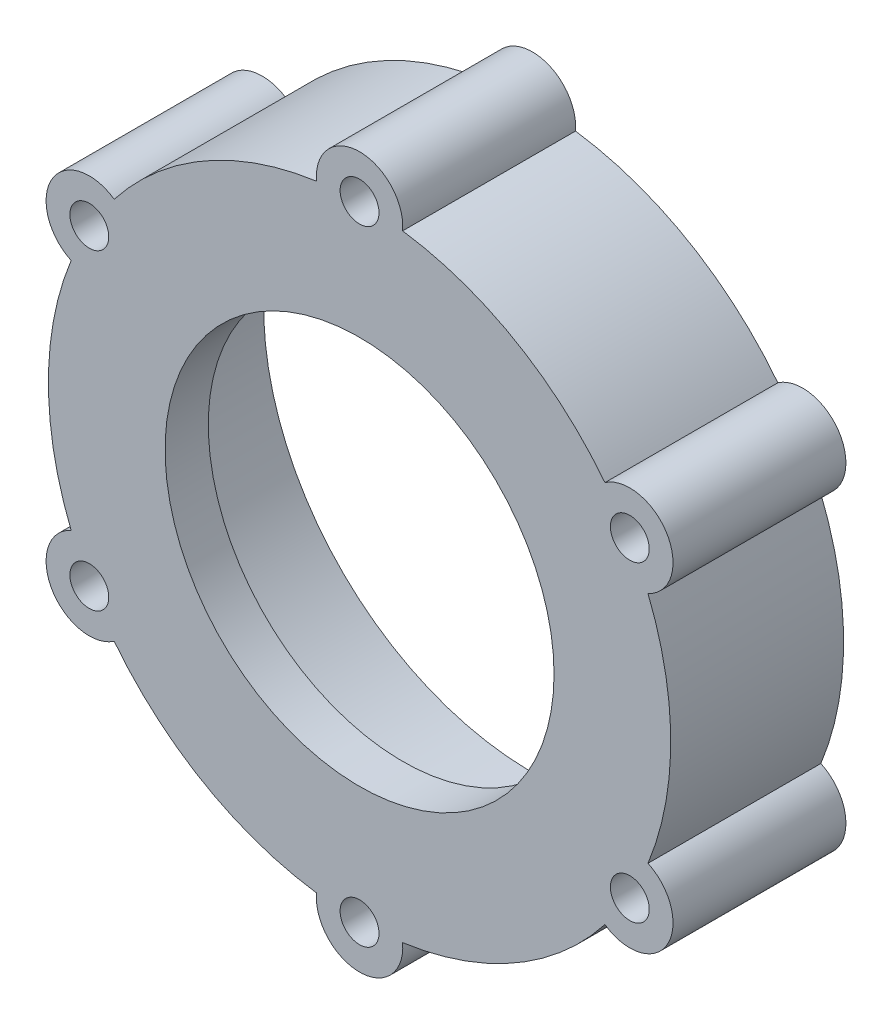
ISO-10303-21;
HEADER;
FILE_DESCRIPTION(('STEP AP214'),'2;1');
FILE_NAME('part.step','',(''),(''),'','','');
FILE_SCHEMA(('AUTOMOTIVE_DESIGN { 1 0 10303 214 1 1 1 1 }'));
ENDSEC;
DATA;
#1=APPLICATION_CONTEXT('core data for automotive mechanical design processes');
#2=APPLICATION_PROTOCOL_DEFINITION('international standard','automotive_design',2000,#1);
#3=PRODUCT_CONTEXT('',#1,'mechanical');
#4=PRODUCT('Part','Part','',(#3));
#5=PRODUCT_RELATED_PRODUCT_CATEGORY('part','',(#4));
#6=PRODUCT_DEFINITION_FORMATION('','',#4);
#7=PRODUCT_DEFINITION_CONTEXT('part definition',#1,'design');
#8=PRODUCT_DEFINITION('design','',#6,#7);
#9=PRODUCT_DEFINITION_SHAPE('','',#8);
#10=(LENGTH_UNIT() NAMED_UNIT(*) SI_UNIT(.MILLI.,.METRE.));
#11=(NAMED_UNIT(*) PLANE_ANGLE_UNIT() SI_UNIT($,.RADIAN.));
#12=(NAMED_UNIT(*) SI_UNIT($,.STERADIAN.) SOLID_ANGLE_UNIT());
#13=UNCERTAINTY_MEASURE_WITH_UNIT(LENGTH_MEASURE(1.E-05),#10,'distance_accuracy_value','');
#14=(GEOMETRIC_REPRESENTATION_CONTEXT(3) GLOBAL_UNCERTAINTY_ASSIGNED_CONTEXT((#13)) GLOBAL_UNIT_ASSIGNED_CONTEXT((#10,
#11,#12)) REPRESENTATION_CONTEXT('',''));
#15=CARTESIAN_POINT('',(0.,0.,0.));
#16=DIRECTION('',(0.,0.,1.));
#17=DIRECTION('',(1.,0.,0.));
#18=AXIS2_PLACEMENT_3D('',#15,#16,#17);
#19=CARTESIAN_POINT('',(0.,0.,15.));
#20=DIRECTION('',(0.,0.,-1.));
#21=DIRECTION('',(-1.,0.,0.));
#22=AXIS2_PLACEMENT_3D('',#19,#20,#21);
#23=CYLINDRICAL_SURFACE('',#22,36.);
#24=CARTESIAN_POINT('',(0.,0.,0.));
#25=DIRECTION('',(0.,0.,1.));
#26=DIRECTION('',(1.,0.,0.));
#27=AXIS2_PLACEMENT_3D('',#24,#25,#26);
#28=CIRCLE('',#27,36.);
#29=CARTESIAN_POINT('',(33.3671930707812,-13.5140825281337,0.));
#30=VERTEX_POINT('',#29);
#31=CARTESIAN_POINT('',(33.3671930707813,13.5140825281336,0.));
#32=VERTEX_POINT('',#31);
#33=EDGE_CURVE('E136',#30,#32,#28,.T.);
#34=ORIENTED_EDGE('',*,*,#33,.T.);
#35=DIRECTION('',(0.,0.,-1.));
#36=VECTOR('',#35,1.);
#37=CARTESIAN_POINT('',(33.3671930707813,13.5140825281336,10.));
#38=LINE('',#37,#36);
#39=CARTESIAN_POINT('',(33.3671930707813,13.5140825281336,20.));
#40=VERTEX_POINT('',#39);
#41=EDGE_CURVE('E122',#32,#40,#38,.F.);
#42=ORIENTED_EDGE('',*,*,#41,.T.);
#43=CARTESIAN_POINT('',(0.,0.,20.));
#44=DIRECTION('',(0.,0.,1.));
#45=DIRECTION('',(1.,0.,0.));
#46=AXIS2_PLACEMENT_3D('',#43,#44,#45);
#47=CIRCLE('',#46,36.);
#48=CARTESIAN_POINT('',(33.3671930707812,-13.5140825281337,20.));
#49=VERTEX_POINT('',#48);
#50=EDGE_CURVE('E332',#49,#40,#47,.T.);
#51=ORIENTED_EDGE('',*,*,#50,.F.);
#52=DIRECTION('',(0.,0.,-1.));
#53=VECTOR('',#52,1.);
#54=CARTESIAN_POINT('',(33.3671930707812,-13.5140825281337,10.));
#55=LINE('',#54,#53);
#56=EDGE_CURVE('E140',#49,#30,#55,.T.);
#57=ORIENTED_EDGE('',*,*,#56,.T.);
#58=EDGE_LOOP('',(#34,#42,#51,#57));
#59=FACE_BOUND('',#58,.T.);
#60=ADVANCED_FACE('F34',(#59),#23,.T.);
#61=CARTESIAN_POINT('',(4.98005775718744,-35.6538781163435,0.));
#62=VERTEX_POINT('',#61);
#63=CARTESIAN_POINT('',(28.3871353135938,-22.1397955882098,0.));
#64=VERTEX_POINT('',#63);
#65=EDGE_CURVE('E141',#62,#64,#28,.T.);
#66=ORIENTED_EDGE('',*,*,#65,.T.);
#67=DIRECTION('',(0.,0.,-1.));
#68=VECTOR('',#67,1.);
#69=CARTESIAN_POINT('',(28.3871353135938,-22.1397955882098,10.));
#70=LINE('',#69,#68);
#71=CARTESIAN_POINT('',(28.3871353135938,-22.1397955882098,20.));
#72=VERTEX_POINT('',#71);
#73=EDGE_CURVE('E209',#64,#72,#70,.F.);
#74=ORIENTED_EDGE('',*,*,#73,.T.);
#75=CARTESIAN_POINT('',(4.98005775718743,-35.6538781163435,20.));
#76=VERTEX_POINT('',#75);
#77=EDGE_CURVE('E328',#76,#72,#47,.T.);
#78=ORIENTED_EDGE('',*,*,#77,.F.);
#79=DIRECTION('',(0.,0.,-1.));
#80=VECTOR('',#79,1.);
#81=CARTESIAN_POINT('',(4.98005775718743,-35.6538781163435,10.));
#82=LINE('',#81,#80);
#83=EDGE_CURVE('E201',#76,#62,#82,.T.);
#84=ORIENTED_EDGE('',*,*,#83,.T.);
#85=EDGE_LOOP('',(#66,#74,#78,#84));
#86=FACE_BOUND('',#85,.T.);
#87=ADVANCED_FACE('F293',(#86),#23,.T.);
#88=CARTESIAN_POINT('',(-28.3871353135938,-22.1397955882098,0.));
#89=VERTEX_POINT('',#88);
#90=CARTESIAN_POINT('',(-4.98005775718744,-35.6538781163435,0.));
#91=VERTEX_POINT('',#90);
#92=EDGE_CURVE('E143',#89,#91,#28,.T.);
#93=ORIENTED_EDGE('',*,*,#92,.T.);
#94=DIRECTION('',(0.,0.,-1.));
#95=VECTOR('',#94,1.);
#96=CARTESIAN_POINT('',(-4.98005775718744,-35.6538781163435,10.));
#97=LINE('',#96,#95);
#98=CARTESIAN_POINT('',(-4.98005775718744,-35.6538781163435,20.));
#99=VERTEX_POINT('',#98);
#100=EDGE_CURVE('E198',#91,#99,#97,.F.);
#101=ORIENTED_EDGE('',*,*,#100,.T.);
#102=CARTESIAN_POINT('',(-28.3871353135938,-22.1397955882098,20.));
#103=VERTEX_POINT('',#102);
#104=EDGE_CURVE('E326',#103,#99,#47,.T.);
#105=ORIENTED_EDGE('',*,*,#104,.F.);
#106=DIRECTION('',(0.,0.,-1.));
#107=VECTOR('',#106,1.);
#108=CARTESIAN_POINT('',(-28.3871353135938,-22.1397955882098,10.));
#109=LINE('',#108,#107);
#110=EDGE_CURVE('E190',#103,#89,#109,.T.);
#111=ORIENTED_EDGE('',*,*,#110,.T.);
#112=EDGE_LOOP('',(#93,#101,#105,#111));
#113=FACE_BOUND('',#112,.T.);
#114=ADVANCED_FACE('F297',(#113),#23,.T.);
#115=CARTESIAN_POINT('',(-33.3671930707812,13.5140825281337,0.));
#116=VERTEX_POINT('',#115);
#117=CARTESIAN_POINT('',(-33.3671930707812,-13.5140825281337,0.));
#118=VERTEX_POINT('',#117);
#119=EDGE_CURVE('E42',#116,#118,#28,.T.);
#120=ORIENTED_EDGE('',*,*,#119,.T.);
#121=DIRECTION('',(0.,0.,-1.));
#122=VECTOR('',#121,1.);
#123=CARTESIAN_POINT('',(-33.3671930707812,-13.5140825281337,10.));
#124=LINE('',#123,#122);
#125=CARTESIAN_POINT('',(-33.3671930707812,-13.5140825281337,20.));
#126=VERTEX_POINT('',#125);
#127=EDGE_CURVE('E187',#118,#126,#124,.F.);
#128=ORIENTED_EDGE('',*,*,#127,.T.);
#129=CARTESIAN_POINT('',(-33.3671930707812,13.5140825281337,20.));
#130=VERTEX_POINT('',#129);
#131=EDGE_CURVE('E158',#130,#126,#47,.T.);
#132=ORIENTED_EDGE('',*,*,#131,.F.);
#133=DIRECTION('',(0.,0.,-1.));
#134=VECTOR('',#133,1.);
#135=CARTESIAN_POINT('',(-33.3671930707812,13.5140825281337,10.));
#136=LINE('',#135,#134);
#137=EDGE_CURVE('E179',#130,#116,#136,.T.);
#138=ORIENTED_EDGE('',*,*,#137,.T.);
#139=EDGE_LOOP('',(#120,#128,#132,#138));
#140=FACE_BOUND('',#139,.T.);
#141=ADVANCED_FACE('F309',(#140),#23,.T.);
#142=CARTESIAN_POINT('',(-4.98005775718743,35.6538781163435,0.));
#143=VERTEX_POINT('',#142);
#144=CARTESIAN_POINT('',(-28.3871353135938,22.1397955882098,0.));
#145=VERTEX_POINT('',#144);
#146=EDGE_CURVE('E11',#143,#145,#28,.T.);
#147=ORIENTED_EDGE('',*,*,#146,.T.);
#148=DIRECTION('',(0.,0.,-1.));
#149=VECTOR('',#148,1.);
#150=CARTESIAN_POINT('',(-28.3871353135938,22.1397955882098,10.));
#151=LINE('',#150,#149);
#152=CARTESIAN_POINT('',(-28.3871353135938,22.1397955882098,20.));
#153=VERTEX_POINT('',#152);
#154=EDGE_CURVE('E176',#145,#153,#151,.F.);
#155=ORIENTED_EDGE('',*,*,#154,.T.);
#156=CARTESIAN_POINT('',(-4.98005775718744,35.6538781163435,20.));
#157=VERTEX_POINT('',#156);
#158=EDGE_CURVE('E153',#157,#153,#47,.T.);
#159=ORIENTED_EDGE('',*,*,#158,.F.);
#160=DIRECTION('',(0.,0.,-1.));
#161=VECTOR('',#160,1.);
#162=CARTESIAN_POINT('',(-4.98005775718744,35.6538781163435,10.));
#163=LINE('',#162,#161);
#164=EDGE_CURVE('E168',#157,#143,#163,.T.);
#165=ORIENTED_EDGE('',*,*,#164,.T.);
#166=EDGE_LOOP('',(#147,#155,#159,#165));
#167=FACE_BOUND('',#166,.T.);
#168=ADVANCED_FACE('F266',(#167),#23,.T.);
#169=CARTESIAN_POINT('',(0.,0.,0.));
#170=DIRECTION('',(0.,0.,1.));
#171=DIRECTION('',(1.,0.,0.));
#172=AXIS2_PLACEMENT_3D('',#169,#170,#171);
#173=PLANE('',#172);
#174=CARTESIAN_POINT('',(0.,36.1,0.));
#175=DIRECTION('',(0.,0.,-1.));
#176=DIRECTION('',(-1.,0.,0.));
#177=AXIS2_PLACEMENT_3D('',#174,#175,#176);
#178=CIRCLE('',#177,2.25);
#179=CARTESIAN_POINT('',(-2.24999999999995,36.1,0.));
#180=VERTEX_POINT('',#179);
#181=EDGE_CURVE('E248',#180,#180,#178,.T.);
#182=ORIENTED_EDGE('',*,*,#181,.F.);
#183=EDGE_LOOP('',(#182));
#184=FACE_BOUND('',#183,.T.);
#185=CARTESIAN_POINT('',(-31.2635170766182,18.05,0.));
#186=DIRECTION('',(0.,0.,-1.));
#187=DIRECTION('',(-1.,0.,0.));
#188=AXIS2_PLACEMENT_3D('',#185,#186,#187);
#189=CIRCLE('',#188,2.25);
#190=CARTESIAN_POINT('',(-33.5135170766182,18.05,0.));
#191=VERTEX_POINT('',#190);
#192=EDGE_CURVE('E242',#191,#191,#189,.T.);
#193=ORIENTED_EDGE('',*,*,#192,.F.);
#194=EDGE_LOOP('',(#193));
#195=FACE_BOUND('',#194,.T.);
#196=CARTESIAN_POINT('',(-31.2635170766182,-18.05,0.));
#197=DIRECTION('',(0.,0.,-1.));
#198=DIRECTION('',(-1.,0.,0.));
#199=AXIS2_PLACEMENT_3D('',#196,#197,#198);
#200=CIRCLE('',#199,2.25);
#201=CARTESIAN_POINT('',(-33.5135170766182,-18.05,0.));
#202=VERTEX_POINT('',#201);
#203=EDGE_CURVE('E236',#202,#202,#200,.T.);
#204=ORIENTED_EDGE('',*,*,#203,.F.);
#205=EDGE_LOOP('',(#204));
#206=FACE_BOUND('',#205,.T.);
#207=CARTESIAN_POINT('',(0.,-36.1,0.));
#208=DIRECTION('',(0.,0.,-1.));
#209=DIRECTION('',(-1.,0.,0.));
#210=AXIS2_PLACEMENT_3D('',#207,#208,#209);
#211=CIRCLE('',#210,2.25);
#212=CARTESIAN_POINT('',(-2.25000000000005,-36.1,0.));
#213=VERTEX_POINT('',#212);
#214=EDGE_CURVE('E230',#213,#213,#211,.T.);
#215=ORIENTED_EDGE('',*,*,#214,.F.);
#216=EDGE_LOOP('',(#215));
#217=FACE_BOUND('',#216,.T.);
#218=CARTESIAN_POINT('',(31.2635170766182,-18.05,0.));
#219=DIRECTION('',(0.,0.,-1.));
#220=DIRECTION('',(-1.,0.,0.));
#221=AXIS2_PLACEMENT_3D('',#218,#219,#220);
#222=CIRCLE('',#221,2.25);
#223=CARTESIAN_POINT('',(29.0135170766182,-18.05,0.));
#224=VERTEX_POINT('',#223);
#225=EDGE_CURVE('E224',#224,#224,#222,.T.);
#226=ORIENTED_EDGE('',*,*,#225,.F.);
#227=EDGE_LOOP('',(#226));
#228=FACE_BOUND('',#227,.T.);
#229=CARTESIAN_POINT('',(31.2635170766182,18.05,0.));
#230=DIRECTION('',(0.,0.,-1.));
#231=DIRECTION('',(-1.,0.,0.));
#232=AXIS2_PLACEMENT_3D('',#229,#230,#231);
#233=CIRCLE('',#232,2.25);
#234=CARTESIAN_POINT('',(29.0135170766183,18.05,0.));
#235=VERTEX_POINT('',#234);
#236=EDGE_CURVE('E218',#235,#235,#233,.T.);
#237=ORIENTED_EDGE('',*,*,#236,.F.);
#238=EDGE_LOOP('',(#237));
#239=FACE_BOUND('',#238,.T.);
#240=CARTESIAN_POINT('',(0.,0.,0.));
#241=DIRECTION('',(0.,0.,1.));
#242=DIRECTION('',(1.,0.,0.));
#243=AXIS2_PLACEMENT_3D('',#240,#241,#242);
#244=CIRCLE('',#243,31.1);
#245=CARTESIAN_POINT('',(31.1,0.,0.));
#246=VERTEX_POINT('',#245);
#247=EDGE_CURVE('E144',#246,#246,#244,.T.);
#248=ORIENTED_EDGE('',*,*,#247,.T.);
#249=EDGE_LOOP('',(#248));
#250=FACE_BOUND('',#249,.T.);
#251=CARTESIAN_POINT('',(28.3871353135938,22.1397955882098,0.));
#252=VERTEX_POINT('',#251);
#253=CARTESIAN_POINT('',(4.98005775718744,35.6538781163435,0.));
#254=VERTEX_POINT('',#253);
#255=EDGE_CURVE('E43',#252,#254,#28,.T.);
#256=ORIENTED_EDGE('',*,*,#255,.F.);
#257=CARTESIAN_POINT('',(31.2635170766182,18.05,0.));
#258=DIRECTION('',(0.,0.,-1.));
#259=DIRECTION('',(-1.,0.,0.));
#260=AXIS2_PLACEMENT_3D('',#257,#258,#259);
#261=CIRCLE('',#260,5.);
#262=EDGE_CURVE('E50',#252,#32,#261,.T.);
#263=ORIENTED_EDGE('',*,*,#262,.T.);
#264=ORIENTED_EDGE('',*,*,#33,.F.);
#265=CARTESIAN_POINT('',(31.2635170766182,-18.05,0.));
#266=DIRECTION('',(0.,0.,-1.));
#267=DIRECTION('',(-1.,0.,0.));
#268=AXIS2_PLACEMENT_3D('',#265,#266,#267);
#269=CIRCLE('',#268,5.);
#270=EDGE_CURVE('E58',#30,#64,#269,.T.);
#271=ORIENTED_EDGE('',*,*,#270,.T.);
#272=ORIENTED_EDGE('',*,*,#65,.F.);
#273=CARTESIAN_POINT('',(0.,-36.1,0.));
#274=DIRECTION('',(0.,0.,-1.));
#275=DIRECTION('',(-1.,0.,0.));
#276=AXIS2_PLACEMENT_3D('',#273,#274,#275);
#277=CIRCLE('',#276,5.);
#278=EDGE_CURVE('E206',#62,#91,#277,.T.);
#279=ORIENTED_EDGE('',*,*,#278,.T.);
#280=ORIENTED_EDGE('',*,*,#92,.F.);
#281=CARTESIAN_POINT('',(-31.2635170766182,-18.05,0.));
#282=DIRECTION('',(0.,0.,-1.));
#283=DIRECTION('',(-1.,0.,0.));
#284=AXIS2_PLACEMENT_3D('',#281,#282,#283);
#285=CIRCLE('',#284,5.);
#286=EDGE_CURVE('E195',#89,#118,#285,.T.);
#287=ORIENTED_EDGE('',*,*,#286,.T.);
#288=ORIENTED_EDGE('',*,*,#119,.F.);
#289=CARTESIAN_POINT('',(-31.2635170766182,18.05,0.));
#290=DIRECTION('',(0.,0.,-1.));
#291=DIRECTION('',(-1.,0.,0.));
#292=AXIS2_PLACEMENT_3D('',#289,#290,#291);
#293=CIRCLE('',#292,5.);
#294=EDGE_CURVE('E184',#116,#145,#293,.T.);
#295=ORIENTED_EDGE('',*,*,#294,.T.);
#296=ORIENTED_EDGE('',*,*,#146,.F.);
#297=CARTESIAN_POINT('',(0.,36.1,0.));
#298=DIRECTION('',(0.,0.,-1.));
#299=DIRECTION('',(-1.,0.,0.));
#300=AXIS2_PLACEMENT_3D('',#297,#298,#299);
#301=CIRCLE('',#300,5.);
#302=EDGE_CURVE('E174',#143,#254,#301,.T.);
#303=ORIENTED_EDGE('',*,*,#302,.T.);
#304=EDGE_LOOP('',(#256,#263,#264,#271,#272,#279,#280,#287,#288,#295,#296,#303));
#305=FACE_BOUND('',#304,.T.);
#306=ADVANCED_FACE('F135',(#184,#195,#206,#217,#228,#239,#250,#305),#173,.F.);
#307=CARTESIAN_POINT('',(28.3871353135938,22.1397955882098,20.));
#308=VERTEX_POINT('',#307);
#309=CARTESIAN_POINT('',(4.98005775718744,35.6538781163435,20.));
#310=VERTEX_POINT('',#309);
#311=EDGE_CURVE('E159',#308,#310,#47,.T.);
#312=ORIENTED_EDGE('',*,*,#311,.F.);
#313=DIRECTION('',(0.,0.,-1.));
#314=VECTOR('',#313,1.);
#315=CARTESIAN_POINT('',(28.3871353135938,22.1397955882098,10.));
#316=LINE('',#315,#314);
#317=EDGE_CURVE('E130',#308,#252,#316,.T.);
#318=ORIENTED_EDGE('',*,*,#317,.T.);
#319=ORIENTED_EDGE('',*,*,#255,.T.);
#320=DIRECTION('',(0.,0.,-1.));
#321=VECTOR('',#320,1.);
#322=CARTESIAN_POINT('',(4.98005775718744,35.6538781163435,10.));
#323=LINE('',#322,#321);
#324=EDGE_CURVE('E164',#254,#310,#323,.F.);
#325=ORIENTED_EDGE('',*,*,#324,.T.);
#326=EDGE_LOOP('',(#312,#318,#319,#325));
#327=FACE_BOUND('',#326,.T.);
#328=ADVANCED_FACE('F36',(#327),#23,.T.);
#329=CARTESIAN_POINT('',(0.,0.,15.));
#330=DIRECTION('',(0.,0.,-1.));
#331=DIRECTION('',(-1.,0.,0.));
#332=AXIS2_PLACEMENT_3D('',#329,#330,#331);
#333=CYLINDRICAL_SURFACE('',#332,31.1);
#334=ORIENTED_EDGE('',*,*,#247,.F.);
#335=EDGE_LOOP('',(#334));
#336=FACE_BOUND('',#335,.T.);
#337=CARTESIAN_POINT('',(0.,0.,15.));
#338=DIRECTION('',(0.,0.,1.));
#339=DIRECTION('',(1.,0.,0.));
#340=AXIS2_PLACEMENT_3D('',#337,#338,#339);
#341=CIRCLE('',#340,31.1);
#342=CARTESIAN_POINT('',(31.1,0.,15.));
#343=VERTEX_POINT('',#342);
#344=EDGE_CURVE('E149',#343,#343,#341,.T.);
#345=ORIENTED_EDGE('',*,*,#344,.T.);
#346=EDGE_LOOP('',(#345));
#347=FACE_BOUND('',#346,.T.);
#348=ADVANCED_FACE('F300',(#336,#347),#333,.F.);
#349=CARTESIAN_POINT('',(0.,0.,15.));
#350=DIRECTION('',(0.,0.,1.));
#351=DIRECTION('',(1.,0.,0.));
#352=AXIS2_PLACEMENT_3D('',#349,#350,#351);
#353=PLANE('',#352);
#354=CARTESIAN_POINT('',(0.,0.,15.));
#355=DIRECTION('',(0.,0.,1.));
#356=DIRECTION('',(1.,0.,0.));
#357=AXIS2_PLACEMENT_3D('',#354,#355,#356);
#358=CIRCLE('',#357,22.5);
#359=CARTESIAN_POINT('',(22.5,0.,15.));
#360=VERTEX_POINT('',#359);
#361=EDGE_CURVE('E163',#360,#360,#358,.T.);
#362=ORIENTED_EDGE('',*,*,#361,.T.);
#363=EDGE_LOOP('',(#362));
#364=FACE_BOUND('',#363,.T.);
#365=ORIENTED_EDGE('',*,*,#344,.F.);
#366=EDGE_LOOP('',(#365));
#367=FACE_BOUND('',#366,.T.);
#368=ADVANCED_FACE('F304',(#364,#367),#353,.F.);
#369=CARTESIAN_POINT('',(0.,0.,20.));
#370=DIRECTION('',(0.,0.,1.));
#371=DIRECTION('',(1.,0.,0.));
#372=AXIS2_PLACEMENT_3D('',#369,#370,#371);
#373=PLANE('',#372);
#374=CARTESIAN_POINT('',(0.,36.1,20.));
#375=DIRECTION('',(0.,0.,-1.));
#376=DIRECTION('',(-1.,0.,0.));
#377=AXIS2_PLACEMENT_3D('',#374,#375,#376);
#378=CIRCLE('',#377,2.25);
#379=CARTESIAN_POINT('',(-2.24999999999995,36.1,20.));
#380=VERTEX_POINT('',#379);
#381=EDGE_CURVE('E221',#380,#380,#378,.T.);
#382=ORIENTED_EDGE('',*,*,#381,.T.);
#383=EDGE_LOOP('',(#382));
#384=FACE_BOUND('',#383,.T.);
#385=CARTESIAN_POINT('',(-31.2635170766182,18.05,20.));
#386=DIRECTION('',(0.,0.,-1.));
#387=DIRECTION('',(-1.,0.,0.));
#388=AXIS2_PLACEMENT_3D('',#385,#386,#387);
#389=CIRCLE('',#388,2.25);
#390=CARTESIAN_POINT('',(-33.5135170766182,18.05,20.));
#391=VERTEX_POINT('',#390);
#392=EDGE_CURVE('E245',#391,#391,#389,.T.);
#393=ORIENTED_EDGE('',*,*,#392,.T.);
#394=EDGE_LOOP('',(#393));
#395=FACE_BOUND('',#394,.T.);
#396=CARTESIAN_POINT('',(-31.2635170766182,-18.05,20.));
#397=DIRECTION('',(0.,0.,-1.));
#398=DIRECTION('',(-1.,0.,0.));
#399=AXIS2_PLACEMENT_3D('',#396,#397,#398);
#400=CIRCLE('',#399,2.25);
#401=CARTESIAN_POINT('',(-33.5135170766182,-18.05,20.));
#402=VERTEX_POINT('',#401);
#403=EDGE_CURVE('E239',#402,#402,#400,.T.);
#404=ORIENTED_EDGE('',*,*,#403,.T.);
#405=EDGE_LOOP('',(#404));
#406=FACE_BOUND('',#405,.T.);
#407=CARTESIAN_POINT('',(0.,-36.1,20.));
#408=DIRECTION('',(0.,0.,-1.));
#409=DIRECTION('',(-1.,0.,0.));
#410=AXIS2_PLACEMENT_3D('',#407,#408,#409);
#411=CIRCLE('',#410,2.25);
#412=CARTESIAN_POINT('',(-2.25000000000005,-36.1,20.));
#413=VERTEX_POINT('',#412);
#414=EDGE_CURVE('E233',#413,#413,#411,.T.);
#415=ORIENTED_EDGE('',*,*,#414,.T.);
#416=EDGE_LOOP('',(#415));
#417=FACE_BOUND('',#416,.T.);
#418=CARTESIAN_POINT('',(31.2635170766182,-18.05,20.));
#419=DIRECTION('',(0.,0.,-1.));
#420=DIRECTION('',(-1.,0.,0.));
#421=AXIS2_PLACEMENT_3D('',#418,#419,#420);
#422=CIRCLE('',#421,2.25);
#423=CARTESIAN_POINT('',(29.0135170766182,-18.05,20.));
#424=VERTEX_POINT('',#423);
#425=EDGE_CURVE('E227',#424,#424,#422,.T.);
#426=ORIENTED_EDGE('',*,*,#425,.T.);
#427=EDGE_LOOP('',(#426));
#428=FACE_BOUND('',#427,.T.);
#429=CARTESIAN_POINT('',(31.2635170766182,18.05,20.));
#430=DIRECTION('',(0.,0.,-1.));
#431=DIRECTION('',(-1.,0.,0.));
#432=AXIS2_PLACEMENT_3D('',#429,#430,#431);
#433=CIRCLE('',#432,2.25);
#434=CARTESIAN_POINT('',(29.0135170766183,18.05,20.));
#435=VERTEX_POINT('',#434);
#436=EDGE_CURVE('E138',#435,#435,#433,.T.);
#437=ORIENTED_EDGE('',*,*,#436,.T.);
#438=EDGE_LOOP('',(#437));
#439=FACE_BOUND('',#438,.T.);
#440=ORIENTED_EDGE('',*,*,#50,.T.);
#441=CARTESIAN_POINT('',(31.2635170766182,18.05,20.));
#442=DIRECTION('',(0.,0.,1.));
#443=DIRECTION('',(1.,0.,0.));
#444=AXIS2_PLACEMENT_3D('',#441,#442,#443);
#445=CIRCLE('',#444,5.);
#446=EDGE_CURVE('E125',#308,#40,#445,.F.);
#447=ORIENTED_EDGE('',*,*,#446,.F.);
#448=ORIENTED_EDGE('',*,*,#311,.T.);
#449=CARTESIAN_POINT('',(0.,36.1,20.));
#450=DIRECTION('',(0.,0.,1.));
#451=DIRECTION('',(1.,0.,0.));
#452=AXIS2_PLACEMENT_3D('',#449,#450,#451);
#453=CIRCLE('',#452,5.);
#454=EDGE_CURVE('E171',#157,#310,#453,.F.);
#455=ORIENTED_EDGE('',*,*,#454,.F.);
#456=ORIENTED_EDGE('',*,*,#158,.T.);
#457=CARTESIAN_POINT('',(-31.2635170766182,18.05,20.));
#458=DIRECTION('',(0.,0.,1.));
#459=DIRECTION('',(1.,0.,0.));
#460=AXIS2_PLACEMENT_3D('',#457,#458,#459);
#461=CIRCLE('',#460,5.);
#462=EDGE_CURVE('E182',#130,#153,#461,.F.);
#463=ORIENTED_EDGE('',*,*,#462,.F.);
#464=ORIENTED_EDGE('',*,*,#131,.T.);
#465=CARTESIAN_POINT('',(-31.2635170766182,-18.05,20.));
#466=DIRECTION('',(0.,0.,1.));
#467=DIRECTION('',(1.,0.,0.));
#468=AXIS2_PLACEMENT_3D('',#465,#466,#467);
#469=CIRCLE('',#468,5.);
#470=EDGE_CURVE('E193',#103,#126,#469,.F.);
#471=ORIENTED_EDGE('',*,*,#470,.F.);
#472=ORIENTED_EDGE('',*,*,#104,.T.);
#473=CARTESIAN_POINT('',(0.,-36.1,20.));
#474=DIRECTION('',(0.,0.,1.));
#475=DIRECTION('',(1.,0.,0.));
#476=AXIS2_PLACEMENT_3D('',#473,#474,#475);
#477=CIRCLE('',#476,5.);
#478=EDGE_CURVE('E204',#76,#99,#477,.F.);
#479=ORIENTED_EDGE('',*,*,#478,.F.);
#480=ORIENTED_EDGE('',*,*,#77,.T.);
#481=CARTESIAN_POINT('',(31.2635170766182,-18.05,20.));
#482=DIRECTION('',(0.,0.,1.));
#483=DIRECTION('',(1.,0.,0.));
#484=AXIS2_PLACEMENT_3D('',#481,#482,#483);
#485=CIRCLE('',#484,5.);
#486=EDGE_CURVE('E213',#49,#72,#485,.F.);
#487=ORIENTED_EDGE('',*,*,#486,.F.);
#488=EDGE_LOOP('',(#440,#447,#448,#455,#456,#463,#464,#471,#472,#479,#480,#487));
#489=FACE_BOUND('',#488,.T.);
#490=CARTESIAN_POINT('',(0.,0.,20.));
#491=DIRECTION('',(0.,0.,1.));
#492=DIRECTION('',(1.,0.,0.));
#493=AXIS2_PLACEMENT_3D('',#490,#491,#492);
#494=CIRCLE('',#493,22.5);
#495=CARTESIAN_POINT('',(22.5,0.,20.));
#496=VERTEX_POINT('',#495);
#497=EDGE_CURVE('E160',#496,#496,#494,.T.);
#498=ORIENTED_EDGE('',*,*,#497,.F.);
#499=EDGE_LOOP('',(#498));
#500=FACE_BOUND('',#499,.T.);
#501=ADVANCED_FACE('F254',(#384,#395,#406,#417,#428,#439,#489,#500),#373,.T.);
#502=CARTESIAN_POINT('',(0.,0.,15.));
#503=DIRECTION('',(0.,0.,1.));
#504=DIRECTION('',(1.,0.,0.));
#505=AXIS2_PLACEMENT_3D('',#502,#503,#504);
#506=CYLINDRICAL_SURFACE('',#505,22.5);
#507=ORIENTED_EDGE('',*,*,#361,.F.);
#508=EDGE_LOOP('',(#507));
#509=FACE_BOUND('',#508,.T.);
#510=ORIENTED_EDGE('',*,*,#497,.T.);
#511=EDGE_LOOP('',(#510));
#512=FACE_BOUND('',#511,.T.);
#513=ADVANCED_FACE('F340',(#509,#512),#506,.F.);
#514=CARTESIAN_POINT('',(0.,36.1,34.142135623731));
#515=DIRECTION('',(0.,0.,-1.));
#516=DIRECTION('',(-1.,0.,0.));
#517=AXIS2_PLACEMENT_3D('',#514,#515,#516);
#518=CYLINDRICAL_SURFACE('',#517,5.);
#519=ORIENTED_EDGE('',*,*,#324,.F.);
#520=ORIENTED_EDGE('',*,*,#302,.F.);
#521=ORIENTED_EDGE('',*,*,#164,.F.);
#522=ORIENTED_EDGE('',*,*,#454,.T.);
#523=EDGE_LOOP('',(#519,#520,#521,#522));
#524=FACE_BOUND('',#523,.T.);
#525=ADVANCED_FACE('F338',(#524),#518,.T.);
#526=CARTESIAN_POINT('',(-31.2635170766182,18.05,34.142135623731));
#527=DIRECTION('',(0.,0.,-1.));
#528=DIRECTION('',(-1.,0.,0.));
#529=AXIS2_PLACEMENT_3D('',#526,#527,#528);
#530=CYLINDRICAL_SURFACE('',#529,5.);
#531=ORIENTED_EDGE('',*,*,#154,.F.);
#532=ORIENTED_EDGE('',*,*,#294,.F.);
#533=ORIENTED_EDGE('',*,*,#137,.F.);
#534=ORIENTED_EDGE('',*,*,#462,.T.);
#535=EDGE_LOOP('',(#531,#532,#533,#534));
#536=FACE_BOUND('',#535,.T.);
#537=ADVANCED_FACE('F320',(#536),#530,.T.);
#538=CARTESIAN_POINT('',(-31.2635170766182,-18.05,34.142135623731));
#539=DIRECTION('',(0.,0.,-1.));
#540=DIRECTION('',(-1.,0.,0.));
#541=AXIS2_PLACEMENT_3D('',#538,#539,#540);
#542=CYLINDRICAL_SURFACE('',#541,5.);
#543=ORIENTED_EDGE('',*,*,#127,.F.);
#544=ORIENTED_EDGE('',*,*,#286,.F.);
#545=ORIENTED_EDGE('',*,*,#110,.F.);
#546=ORIENTED_EDGE('',*,*,#470,.T.);
#547=EDGE_LOOP('',(#543,#544,#545,#546));
#548=FACE_BOUND('',#547,.T.);
#549=ADVANCED_FACE('F346',(#548),#542,.T.);
#550=CARTESIAN_POINT('',(0.,-36.1,34.142135623731));
#551=DIRECTION('',(0.,0.,-1.));
#552=DIRECTION('',(-1.,0.,0.));
#553=AXIS2_PLACEMENT_3D('',#550,#551,#552);
#554=CYLINDRICAL_SURFACE('',#553,5.);
#555=ORIENTED_EDGE('',*,*,#100,.F.);
#556=ORIENTED_EDGE('',*,*,#278,.F.);
#557=ORIENTED_EDGE('',*,*,#83,.F.);
#558=ORIENTED_EDGE('',*,*,#478,.T.);
#559=EDGE_LOOP('',(#555,#556,#557,#558));
#560=FACE_BOUND('',#559,.T.);
#561=ADVANCED_FACE('F481',(#560),#554,.T.);
#562=CARTESIAN_POINT('',(31.2635170766182,-18.05,34.142135623731));
#563=DIRECTION('',(0.,0.,-1.));
#564=DIRECTION('',(-1.,0.,0.));
#565=AXIS2_PLACEMENT_3D('',#562,#563,#564);
#566=CYLINDRICAL_SURFACE('',#565,5.);
#567=ORIENTED_EDGE('',*,*,#73,.F.);
#568=ORIENTED_EDGE('',*,*,#270,.F.);
#569=ORIENTED_EDGE('',*,*,#56,.F.);
#570=ORIENTED_EDGE('',*,*,#486,.T.);
#571=EDGE_LOOP('',(#567,#568,#569,#570));
#572=FACE_BOUND('',#571,.T.);
#573=ADVANCED_FACE('F289',(#572),#566,.T.);
#574=CARTESIAN_POINT('',(31.2635170766182,18.05,34.142135623731));
#575=DIRECTION('',(0.,0.,-1.));
#576=DIRECTION('',(-1.,0.,0.));
#577=AXIS2_PLACEMENT_3D('',#574,#575,#576);
#578=CYLINDRICAL_SURFACE('',#577,5.);
#579=ORIENTED_EDGE('',*,*,#41,.F.);
#580=ORIENTED_EDGE('',*,*,#262,.F.);
#581=ORIENTED_EDGE('',*,*,#317,.F.);
#582=ORIENTED_EDGE('',*,*,#446,.T.);
#583=EDGE_LOOP('',(#579,#580,#581,#582));
#584=FACE_BOUND('',#583,.T.);
#585=ADVANCED_FACE('F123',(#584),#578,.T.);
#586=CARTESIAN_POINT('',(31.2635170766182,18.05,20.));
#587=DIRECTION('',(0.,0.,-1.));
#588=DIRECTION('',(-1.,0.,0.));
#589=AXIS2_PLACEMENT_3D('',#586,#587,#588);
#590=CYLINDRICAL_SURFACE('',#589,2.25);
#591=ORIENTED_EDGE('',*,*,#436,.F.);
#592=EDGE_LOOP('',(#591));
#593=FACE_BOUND('',#592,.T.);
#594=ORIENTED_EDGE('',*,*,#236,.T.);
#595=EDGE_LOOP('',(#594));
#596=FACE_BOUND('',#595,.T.);
#597=ADVANCED_FACE('F277',(#593,#596),#590,.F.);
#598=CARTESIAN_POINT('',(31.2635170766182,-18.05,20.));
#599=DIRECTION('',(0.,0.,-1.));
#600=DIRECTION('',(-1.,0.,0.));
#601=AXIS2_PLACEMENT_3D('',#598,#599,#600);
#602=CYLINDRICAL_SURFACE('',#601,2.25);
#603=ORIENTED_EDGE('',*,*,#425,.F.);
#604=EDGE_LOOP('',(#603));
#605=FACE_BOUND('',#604,.T.);
#606=ORIENTED_EDGE('',*,*,#225,.T.);
#607=EDGE_LOOP('',(#606));
#608=FACE_BOUND('',#607,.T.);
#609=ADVANCED_FACE('F279',(#605,#608),#602,.F.);
#610=CARTESIAN_POINT('',(0.,-36.1,20.));
#611=DIRECTION('',(0.,0.,-1.));
#612=DIRECTION('',(-1.,0.,0.));
#613=AXIS2_PLACEMENT_3D('',#610,#611,#612);
#614=CYLINDRICAL_SURFACE('',#613,2.25);
#615=ORIENTED_EDGE('',*,*,#414,.F.);
#616=EDGE_LOOP('',(#615));
#617=FACE_BOUND('',#616,.T.);
#618=ORIENTED_EDGE('',*,*,#214,.T.);
#619=EDGE_LOOP('',(#618));
#620=FACE_BOUND('',#619,.T.);
#621=ADVANCED_FACE('F286',(#617,#620),#614,.F.);
#622=CARTESIAN_POINT('',(-31.2635170766182,-18.05,20.));
#623=DIRECTION('',(0.,0.,-1.));
#624=DIRECTION('',(-1.,0.,0.));
#625=AXIS2_PLACEMENT_3D('',#622,#623,#624);
#626=CYLINDRICAL_SURFACE('',#625,2.25);
#627=ORIENTED_EDGE('',*,*,#403,.F.);
#628=EDGE_LOOP('',(#627));
#629=FACE_BOUND('',#628,.T.);
#630=ORIENTED_EDGE('',*,*,#203,.T.);
#631=EDGE_LOOP('',(#630));
#632=FACE_BOUND('',#631,.T.);
#633=ADVANCED_FACE('F517',(#629,#632),#626,.F.);
#634=CARTESIAN_POINT('',(-31.2635170766182,18.05,20.));
#635=DIRECTION('',(0.,0.,-1.));
#636=DIRECTION('',(-1.,0.,0.));
#637=AXIS2_PLACEMENT_3D('',#634,#635,#636);
#638=CYLINDRICAL_SURFACE('',#637,2.25);
#639=ORIENTED_EDGE('',*,*,#392,.F.);
#640=EDGE_LOOP('',(#639));
#641=FACE_BOUND('',#640,.T.);
#642=ORIENTED_EDGE('',*,*,#192,.T.);
#643=EDGE_LOOP('',(#642));
#644=FACE_BOUND('',#643,.T.);
#645=ADVANCED_FACE('F260',(#641,#644),#638,.F.);
#646=CARTESIAN_POINT('',(0.,36.1,20.));
#647=DIRECTION('',(0.,0.,-1.));
#648=DIRECTION('',(-1.,0.,0.));
#649=AXIS2_PLACEMENT_3D('',#646,#647,#648);
#650=CYLINDRICAL_SURFACE('',#649,2.25);
#651=ORIENTED_EDGE('',*,*,#381,.F.);
#652=EDGE_LOOP('',(#651));
#653=FACE_BOUND('',#652,.T.);
#654=ORIENTED_EDGE('',*,*,#181,.T.);
#655=EDGE_LOOP('',(#654));
#656=FACE_BOUND('',#655,.T.);
#657=ADVANCED_FACE('F257',(#653,#656),#650,.F.);
#658=CLOSED_SHELL('',(#60,#87,#114,#141,#168,#306,#328,#348,#368,#501,#513,#525,#537,#549,#561,
#573,#585,#597,#609,#621,#633,#645,#657));
#659=MANIFOLD_SOLID_BREP('B2',#658);
#660=ADVANCED_BREP_SHAPE_REPRESENTATION('',(#18,#659),#14);
#661=SHAPE_DEFINITION_REPRESENTATION(#9,#660);
ENDSEC;
END-ISO-10303-21;
